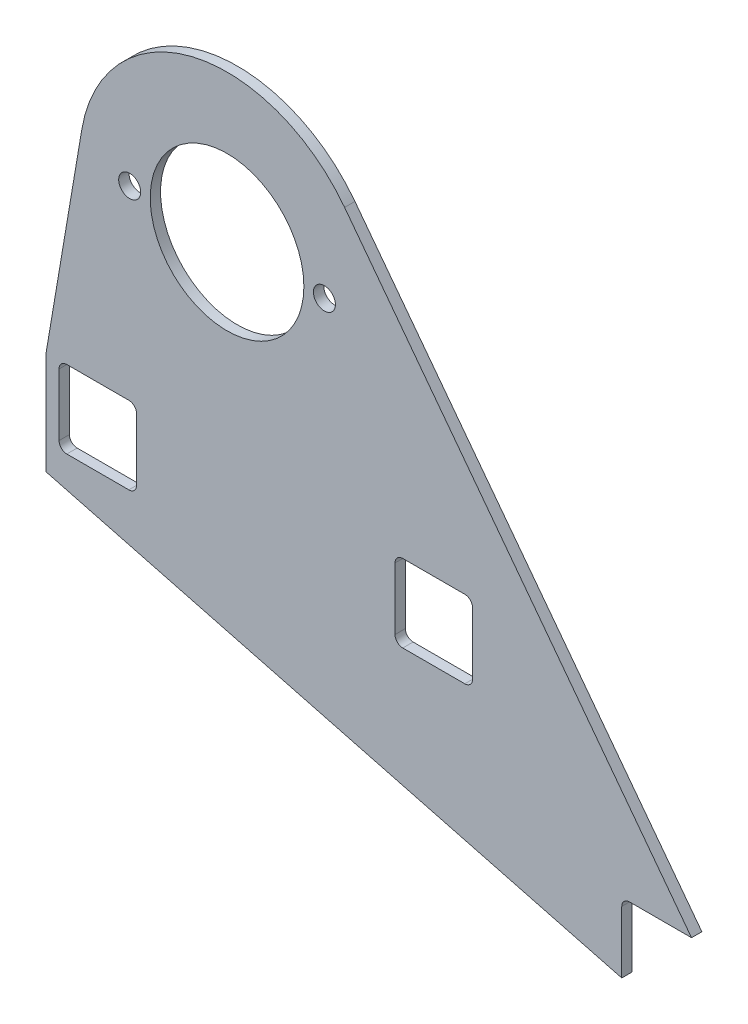
ISO-10303-21;
HEADER;
FILE_DESCRIPTION(('STEP AP214'),'2;1');
FILE_NAME('part.step','',(''),(''),'','','');
FILE_SCHEMA(('AUTOMOTIVE_DESIGN { 1 0 10303 214 1 1 1 1 }'));
ENDSEC;
DATA;
#1=APPLICATION_CONTEXT('core data for automotive mechanical design processes');
#2=APPLICATION_PROTOCOL_DEFINITION('international standard','automotive_design',2000,#1);
#3=PRODUCT_CONTEXT('',#1,'mechanical');
#4=PRODUCT('Part','Part','',(#3));
#5=PRODUCT_RELATED_PRODUCT_CATEGORY('part','',(#4));
#6=PRODUCT_DEFINITION_FORMATION('','',#4);
#7=PRODUCT_DEFINITION_CONTEXT('part definition',#1,'design');
#8=PRODUCT_DEFINITION('design','',#6,#7);
#9=PRODUCT_DEFINITION_SHAPE('','',#8);
#10=(LENGTH_UNIT() NAMED_UNIT(*) SI_UNIT(.MILLI.,.METRE.));
#11=(NAMED_UNIT(*) PLANE_ANGLE_UNIT() SI_UNIT($,.RADIAN.));
#12=(NAMED_UNIT(*) SI_UNIT($,.STERADIAN.) SOLID_ANGLE_UNIT());
#13=UNCERTAINTY_MEASURE_WITH_UNIT(LENGTH_MEASURE(1.E-05),#10,'distance_accuracy_value','');
#14=(GEOMETRIC_REPRESENTATION_CONTEXT(3) GLOBAL_UNCERTAINTY_ASSIGNED_CONTEXT((#13)) GLOBAL_UNIT_ASSIGNED_CONTEXT((#10,
#11,#12)) REPRESENTATION_CONTEXT('',''));
#15=CARTESIAN_POINT('',(0.,0.,0.));
#16=DIRECTION('',(0.,0.,1.));
#17=DIRECTION('',(1.,0.,0.));
#18=AXIS2_PLACEMENT_3D('',#15,#16,#17);
#19=CARTESIAN_POINT('',(-69.9999999999998,-112.,-4.));
#20=DIRECTION('',(-0.2529175302643,-0.96748784120784,0.));
#21=DIRECTION('',(0.96748784120784,-0.2529175302643,0.));
#22=AXIS2_PLACEMENT_3D('',#19,#20,#21);
#23=PLANE('',#22);
#24=DIRECTION('',(0.96748784120784,-0.2529175302643,0.));
#25=VECTOR('',#24,1.);
#26=CARTESIAN_POINT('',(-69.9999999999998,-112.,0.));
#27=LINE('',#26,#25);
#28=CARTESIAN_POINT('',(-69.9999999999998,-112.,0.));
#29=VERTEX_POINT('',#28);
#30=CARTESIAN_POINT('',(152.733197448332,-170.226189319521,0.));
#31=VERTEX_POINT('',#30);
#32=EDGE_CURVE('E331',#29,#31,#27,.T.);
#33=ORIENTED_EDGE('',*,*,#32,.F.);
#34=DIRECTION('',(0.,0.,1.));
#35=VECTOR('',#34,1.);
#36=CARTESIAN_POINT('',(-69.9999999999998,-112.,-4.));
#37=LINE('',#36,#35);
#38=CARTESIAN_POINT('',(-69.9999999999998,-112.,-4.));
#39=VERTEX_POINT('',#38);
#40=EDGE_CURVE('E11',#39,#29,#37,.T.);
#41=ORIENTED_EDGE('',*,*,#40,.F.);
#42=DIRECTION('',(0.96748784120784,-0.2529175302643,0.));
#43=VECTOR('',#42,1.);
#44=CARTESIAN_POINT('',(-69.9999999999998,-112.,-4.));
#45=LINE('',#44,#43);
#46=CARTESIAN_POINT('',(152.733197448332,-170.226189319521,-4.));
#47=VERTEX_POINT('',#46);
#48=EDGE_CURVE('E346',#39,#47,#45,.T.);
#49=ORIENTED_EDGE('',*,*,#48,.T.);
#50=DIRECTION('',(0.,0.,1.));
#51=VECTOR('',#50,1.);
#52=CARTESIAN_POINT('',(152.733197448332,-170.226189319521,-4.));
#53=LINE('',#52,#51);
#54=EDGE_CURVE('E37',#47,#31,#53,.T.);
#55=ORIENTED_EDGE('',*,*,#54,.T.);
#56=EDGE_LOOP('',(#33,#41,#49,#55));
#57=FACE_BOUND('',#56,.T.);
#58=ADVANCED_FACE('F34',(#57),#23,.T.);
#59=CARTESIAN_POINT('',(-69.9999999999998,-72.,-4.));
#60=DIRECTION('',(-1.,0.,0.));
#61=DIRECTION('',(0.,0.,1.));
#62=AXIS2_PLACEMENT_3D('',#59,#60,#61);
#63=PLANE('',#62);
#64=DIRECTION('',(0.,-1.,0.));
#65=VECTOR('',#64,1.);
#66=CARTESIAN_POINT('',(-69.9999999999998,-72.,0.));
#67=LINE('',#66,#65);
#68=CARTESIAN_POINT('',(-69.9999999999998,-72.,0.));
#69=VERTEX_POINT('',#68);
#70=EDGE_CURVE('E350',#69,#29,#67,.T.);
#71=ORIENTED_EDGE('',*,*,#70,.F.);
#72=DIRECTION('',(0.,0.,1.));
#73=VECTOR('',#72,1.);
#74=CARTESIAN_POINT('',(-69.9999999999998,-72.,-4.));
#75=LINE('',#74,#73);
#76=CARTESIAN_POINT('',(-69.9999999999998,-72.,-4.));
#77=VERTEX_POINT('',#76);
#78=EDGE_CURVE('E42',#77,#69,#75,.T.);
#79=ORIENTED_EDGE('',*,*,#78,.F.);
#80=DIRECTION('',(0.,-1.,0.));
#81=VECTOR('',#80,1.);
#82=CARTESIAN_POINT('',(-69.9999999999998,-72.,-4.));
#83=LINE('',#82,#81);
#84=EDGE_CURVE('E368',#77,#39,#83,.T.);
#85=ORIENTED_EDGE('',*,*,#84,.T.);
#86=ORIENTED_EDGE('',*,*,#40,.T.);
#87=EDGE_LOOP('',(#71,#79,#85,#86));
#88=FACE_BOUND('',#87,.T.);
#89=ADVANCED_FACE('F415',(#88),#63,.T.);
#90=CARTESIAN_POINT('',(-69.9999999999998,-72.,-4.));
#91=DIRECTION('',(-0.986021500853317,0.166618125829613,0.));
#92=DIRECTION('',(-0.166618125829613,-0.986021500853317,0.));
#93=AXIS2_PLACEMENT_3D('',#90,#91,#92);
#94=PLANE('',#93);
#95=DIRECTION('',(-0.166618125829613,-0.986021500853317,0.));
#96=VECTOR('',#95,1.);
#97=CARTESIAN_POINT('',(-69.9999999999998,-72.,0.));
#98=LINE('',#97,#96);
#99=CARTESIAN_POINT('',(-56.2278760861603,9.50139862543403,0.));
#100=VERTEX_POINT('',#99);
#101=EDGE_CURVE('E388',#100,#69,#98,.T.);
#102=ORIENTED_EDGE('',*,*,#101,.F.);
#103=DIRECTION('',(0.,0.,1.));
#104=VECTOR('',#103,1.);
#105=CARTESIAN_POINT('',(-56.2278760861603,9.50139862543403,-4.));
#106=LINE('',#105,#104);
#107=CARTESIAN_POINT('',(-56.2278760861603,9.50139862543403,-4.));
#108=VERTEX_POINT('',#107);
#109=EDGE_CURVE('E394',#108,#100,#106,.T.);
#110=ORIENTED_EDGE('',*,*,#109,.F.);
#111=DIRECTION('',(-0.166618125829613,-0.986021500853317,0.));
#112=VECTOR('',#111,1.);
#113=CARTESIAN_POINT('',(-69.9999999999998,-72.,-4.));
#114=LINE('',#113,#112);
#115=EDGE_CURVE('E365',#108,#77,#114,.T.);
#116=ORIENTED_EDGE('',*,*,#115,.T.);
#117=ORIENTED_EDGE('',*,*,#78,.T.);
#118=EDGE_LOOP('',(#102,#110,#116,#117));
#119=FACE_BOUND('',#118,.T.);
#120=ADVANCED_FACE('F435',(#119),#94,.T.);
#121=CARTESIAN_POINT('',(0.,3.88578058618805E-13,-4.));
#122=DIRECTION('',(0.,0.,1.));
#123=DIRECTION('',(1.,0.,0.));
#124=AXIS2_PLACEMENT_3D('',#121,#122,#123);
#125=CYLINDRICAL_SURFACE('',#124,57.0249999999999);
#126=CARTESIAN_POINT('',(0.,3.88578058618805E-13,0.));
#127=DIRECTION('',(0.,0.,1.));
#128=DIRECTION('',(1.,0.,0.));
#129=AXIS2_PLACEMENT_3D('',#126,#127,#128);
#130=CIRCLE('',#129,57.0249999999999);
#131=CARTESIAN_POINT('',(45.4927074926648,34.3840688398982,0.));
#132=VERTEX_POINT('',#131);
#133=EDGE_CURVE('E385',#132,#100,#130,.T.);
#134=ORIENTED_EDGE('',*,*,#133,.F.);
#135=DIRECTION('',(0.,0.,1.));
#136=VECTOR('',#135,1.);
#137=CARTESIAN_POINT('',(45.4927074926648,34.3840688398982,-4.));
#138=LINE('',#137,#136);
#139=CARTESIAN_POINT('',(45.4927074926648,34.3840688398982,-4.));
#140=VERTEX_POINT('',#139);
#141=EDGE_CURVE('E396',#140,#132,#138,.T.);
#142=ORIENTED_EDGE('',*,*,#141,.F.);
#143=CARTESIAN_POINT('',(0.,3.88578058618805E-13,-4.));
#144=DIRECTION('',(0.,0.,1.));
#145=DIRECTION('',(1.,0.,0.));
#146=AXIS2_PLACEMENT_3D('',#143,#144,#145);
#147=CIRCLE('',#146,57.0249999999999);
#148=EDGE_CURVE('E362',#140,#108,#147,.T.);
#149=ORIENTED_EDGE('',*,*,#148,.T.);
#150=ORIENTED_EDGE('',*,*,#109,.T.);
#151=EDGE_LOOP('',(#134,#142,#149,#150));
#152=FACE_BOUND('',#151,.T.);
#153=ADVANCED_FACE('F433',(#152),#125,.T.);
#154=CARTESIAN_POINT('',(179.733197448332,-143.226189319521,-4.));
#155=DIRECTION('',(0.797767777162047,0.602964819638697,0.));
#156=DIRECTION('',(-0.602964819638697,0.797767777162047,0.));
#157=AXIS2_PLACEMENT_3D('',#154,#155,#156);
#158=PLANE('',#157);
#159=DIRECTION('',(-0.602964819638697,0.797767777162047,0.));
#160=VECTOR('',#159,1.);
#161=CARTESIAN_POINT('',(179.733197448332,-143.226189319521,0.));
#162=LINE('',#161,#160);
#163=CARTESIAN_POINT('',(179.733197448332,-143.226189319521,0.));
#164=VERTEX_POINT('',#163);
#165=EDGE_CURVE('E382',#164,#132,#162,.T.);
#166=ORIENTED_EDGE('',*,*,#165,.F.);
#167=DIRECTION('',(0.,0.,1.));
#168=VECTOR('',#167,1.);
#169=CARTESIAN_POINT('',(179.733197448332,-143.226189319521,-4.));
#170=LINE('',#169,#168);
#171=CARTESIAN_POINT('',(179.733197448332,-143.226189319521,-4.));
#172=VERTEX_POINT('',#171);
#173=EDGE_CURVE('E398',#172,#164,#170,.T.);
#174=ORIENTED_EDGE('',*,*,#173,.F.);
#175=DIRECTION('',(-0.602964819638697,0.797767777162047,0.));
#176=VECTOR('',#175,1.);
#177=CARTESIAN_POINT('',(179.733197448332,-143.226189319521,-4.));
#178=LINE('',#177,#176);
#179=EDGE_CURVE('E359',#172,#140,#178,.T.);
#180=ORIENTED_EDGE('',*,*,#179,.T.);
#181=ORIENTED_EDGE('',*,*,#141,.T.);
#182=EDGE_LOOP('',(#166,#174,#180,#181));
#183=FACE_BOUND('',#182,.T.);
#184=ADVANCED_FACE('F429',(#183),#158,.T.);
#185=CARTESIAN_POINT('',(179.733197448332,-143.226189319521,-4.));
#186=DIRECTION('',(0.,-1.,0.));
#187=DIRECTION('',(1.,0.,0.));
#188=AXIS2_PLACEMENT_3D('',#185,#186,#187);
#189=PLANE('',#188);
#190=DIRECTION('',(1.,0.,0.));
#191=VECTOR('',#190,1.);
#192=CARTESIAN_POINT('',(179.733197448332,-143.226189319521,0.));
#193=LINE('',#192,#191);
#194=CARTESIAN_POINT('',(155.733197448332,-143.226189319521,0.));
#195=VERTEX_POINT('',#194);
#196=EDGE_CURVE('E379',#195,#164,#193,.T.);
#197=ORIENTED_EDGE('',*,*,#196,.F.);
#198=DIRECTION('',(0.,0.,1.));
#199=VECTOR('',#198,1.);
#200=CARTESIAN_POINT('',(155.733197448332,-143.226189319521,-4.));
#201=LINE('',#200,#199);
#202=CARTESIAN_POINT('',(155.733197448332,-143.226189319521,-4.));
#203=VERTEX_POINT('',#202);
#204=EDGE_CURVE('E400',#203,#195,#201,.T.);
#205=ORIENTED_EDGE('',*,*,#204,.F.);
#206=DIRECTION('',(1.,0.,0.));
#207=VECTOR('',#206,1.);
#208=CARTESIAN_POINT('',(179.733197448332,-143.226189319521,-4.));
#209=LINE('',#208,#207);
#210=EDGE_CURVE('E356',#203,#172,#209,.T.);
#211=ORIENTED_EDGE('',*,*,#210,.T.);
#212=ORIENTED_EDGE('',*,*,#173,.T.);
#213=EDGE_LOOP('',(#197,#205,#211,#212));
#214=FACE_BOUND('',#213,.T.);
#215=ADVANCED_FACE('F427',(#214),#189,.T.);
#216=CARTESIAN_POINT('',(155.733197448332,-146.226189319521,-4.));
#217=DIRECTION('',(0.,0.,1.));
#218=DIRECTION('',(1.,0.,0.));
#219=AXIS2_PLACEMENT_3D('',#216,#217,#218);
#220=CYLINDRICAL_SURFACE('',#219,2.99999999999999);
#221=CARTESIAN_POINT('',(155.733197448332,-146.226189319521,0.));
#222=DIRECTION('',(0.,0.,-1.));
#223=DIRECTION('',(1.,0.,0.));
#224=AXIS2_PLACEMENT_3D('',#221,#222,#223);
#225=CIRCLE('',#224,2.99999999999999);
#226=CARTESIAN_POINT('',(152.733197448332,-146.226189319521,0.));
#227=VERTEX_POINT('',#226);
#228=EDGE_CURVE('E376',#227,#195,#225,.T.);
#229=ORIENTED_EDGE('',*,*,#228,.F.);
#230=DIRECTION('',(0.,0.,1.));
#231=VECTOR('',#230,1.);
#232=CARTESIAN_POINT('',(152.733197448332,-146.226189319521,-4.));
#233=LINE('',#232,#231);
#234=CARTESIAN_POINT('',(152.733197448332,-146.226189319521,-4.));
#235=VERTEX_POINT('',#234);
#236=EDGE_CURVE('E401',#235,#227,#233,.T.);
#237=ORIENTED_EDGE('',*,*,#236,.F.);
#238=CARTESIAN_POINT('',(155.733197448332,-146.226189319521,-4.));
#239=DIRECTION('',(0.,0.,-1.));
#240=DIRECTION('',(1.,0.,0.));
#241=AXIS2_PLACEMENT_3D('',#238,#239,#240);
#242=CIRCLE('',#241,2.99999999999999);
#243=EDGE_CURVE('E353',#235,#203,#242,.T.);
#244=ORIENTED_EDGE('',*,*,#243,.T.);
#245=ORIENTED_EDGE('',*,*,#204,.T.);
#246=EDGE_LOOP('',(#229,#237,#244,#245));
#247=FACE_BOUND('',#246,.T.);
#248=ADVANCED_FACE('F423',(#247),#220,.F.);
#249=CARTESIAN_POINT('',(152.733197448332,-146.226189319521,-4.));
#250=DIRECTION('',(1.,0.,0.));
#251=DIRECTION('',(0.,0.,-1.));
#252=AXIS2_PLACEMENT_3D('',#249,#250,#251);
#253=PLANE('',#252);
#254=DIRECTION('',(0.,1.,0.));
#255=VECTOR('',#254,1.);
#256=CARTESIAN_POINT('',(152.733197448332,-146.226189319521,0.));
#257=LINE('',#256,#255);
#258=EDGE_CURVE('E373',#31,#227,#257,.T.);
#259=ORIENTED_EDGE('',*,*,#258,.F.);
#260=ORIENTED_EDGE('',*,*,#54,.F.);
#261=DIRECTION('',(0.,1.,0.));
#262=VECTOR('',#261,1.);
#263=CARTESIAN_POINT('',(152.733197448332,-146.226189319521,-4.));
#264=LINE('',#263,#262);
#265=EDGE_CURVE('E349',#47,#235,#264,.T.);
#266=ORIENTED_EDGE('',*,*,#265,.T.);
#267=ORIENTED_EDGE('',*,*,#236,.T.);
#268=EDGE_LOOP('',(#259,#260,#266,#267));
#269=FACE_BOUND('',#268,.T.);
#270=ADVANCED_FACE('F409',(#269),#253,.T.);
#271=CARTESIAN_POINT('',(155.733197448332,-146.226189319521,-4.));
#272=DIRECTION('',(0.,0.,1.));
#273=DIRECTION('',(1.,0.,0.));
#274=AXIS2_PLACEMENT_3D('',#271,#272,#273);
#275=PLANE('',#274);
#276=DIRECTION('',(0.,-1.,0.));
#277=VECTOR('',#276,1.);
#278=CARTESIAN_POINT('',(64.9999999999999,-75.,-4.));
#279=LINE('',#278,#277);
#280=CARTESIAN_POINT('',(64.9999999999999,-75.,-4.));
#281=VERTEX_POINT('',#280);
#282=CARTESIAN_POINT('',(64.9999999999999,-99.,-4.));
#283=VERTEX_POINT('',#282);
#284=EDGE_CURVE('E203',#281,#283,#279,.T.);
#285=ORIENTED_EDGE('',*,*,#284,.T.);
#286=CARTESIAN_POINT('',(68.0000000000001,-99.,-4.));
#287=DIRECTION('',(0.,0.,1.));
#288=DIRECTION('',(1.,0.,0.));
#289=AXIS2_PLACEMENT_3D('',#286,#287,#288);
#290=CIRCLE('',#289,3.);
#291=CARTESIAN_POINT('',(68.0000000000001,-102.,-4.));
#292=VERTEX_POINT('',#291);
#293=EDGE_CURVE('E197',#283,#292,#290,.T.);
#294=ORIENTED_EDGE('',*,*,#293,.T.);
#295=DIRECTION('',(1.,0.,0.));
#296=VECTOR('',#295,1.);
#297=CARTESIAN_POINT('',(68.0000000000001,-102.,-4.));
#298=LINE('',#297,#296);
#299=CARTESIAN_POINT('',(91.9999999999999,-102.,-4.));
#300=VERTEX_POINT('',#299);
#301=EDGE_CURVE('E206',#292,#300,#298,.T.);
#302=ORIENTED_EDGE('',*,*,#301,.T.);
#303=CARTESIAN_POINT('',(91.9999999999999,-99.,-4.));
#304=DIRECTION('',(0.,0.,1.));
#305=DIRECTION('',(1.,0.,0.));
#306=AXIS2_PLACEMENT_3D('',#303,#304,#305);
#307=CIRCLE('',#306,3.);
#308=CARTESIAN_POINT('',(95.,-99.,-4.));
#309=VERTEX_POINT('',#308);
#310=EDGE_CURVE('E50',#300,#309,#307,.T.);
#311=ORIENTED_EDGE('',*,*,#310,.T.);
#312=DIRECTION('',(0.,1.,0.));
#313=VECTOR('',#312,1.);
#314=CARTESIAN_POINT('',(95.,-99.,-4.));
#315=LINE('',#314,#313);
#316=CARTESIAN_POINT('',(95.,-75.,-4.));
#317=VERTEX_POINT('',#316);
#318=EDGE_CURVE('E221',#309,#317,#315,.T.);
#319=ORIENTED_EDGE('',*,*,#318,.T.);
#320=CARTESIAN_POINT('',(91.9999999999999,-75.,-4.));
#321=DIRECTION('',(0.,0.,1.));
#322=DIRECTION('',(1.,0.,0.));
#323=AXIS2_PLACEMENT_3D('',#320,#321,#322);
#324=CIRCLE('',#323,3.);
#325=CARTESIAN_POINT('',(91.9999999999999,-72.,-4.));
#326=VERTEX_POINT('',#325);
#327=EDGE_CURVE('E224',#317,#326,#324,.T.);
#328=ORIENTED_EDGE('',*,*,#327,.T.);
#329=DIRECTION('',(-1.,0.,0.));
#330=VECTOR('',#329,1.);
#331=CARTESIAN_POINT('',(91.9999999999999,-72.,-4.));
#332=LINE('',#331,#330);
#333=CARTESIAN_POINT('',(68.0000000000001,-72.,-4.));
#334=VERTEX_POINT('',#333);
#335=EDGE_CURVE('E227',#326,#334,#332,.T.);
#336=ORIENTED_EDGE('',*,*,#335,.T.);
#337=CARTESIAN_POINT('',(68.0000000000001,-75.,-4.));
#338=DIRECTION('',(0.,0.,1.));
#339=DIRECTION('',(1.,0.,0.));
#340=AXIS2_PLACEMENT_3D('',#337,#338,#339);
#341=CIRCLE('',#340,3.);
#342=EDGE_CURVE('E230',#334,#281,#341,.T.);
#343=ORIENTED_EDGE('',*,*,#342,.T.);
#344=EDGE_LOOP('',(#285,#294,#302,#311,#319,#328,#336,#343));
#345=FACE_BOUND('',#344,.T.);
#346=CARTESIAN_POINT('',(37.6749999999999,0.,-4.));
#347=DIRECTION('',(0.,0.,1.));
#348=DIRECTION('',(1.,0.,0.));
#349=AXIS2_PLACEMENT_3D('',#346,#347,#348);
#350=CIRCLE('',#349,4.25);
#351=CARTESIAN_POINT('',(41.9249999999999,0.,-4.));
#352=VERTEX_POINT('',#351);
#353=EDGE_CURVE('E264',#352,#352,#350,.T.);
#354=ORIENTED_EDGE('',*,*,#353,.T.);
#355=EDGE_LOOP('',(#354));
#356=FACE_BOUND('',#355,.T.);
#357=CARTESIAN_POINT('',(0.,3.88578058618805E-13,-4.));
#358=DIRECTION('',(0.,0.,1.));
#359=DIRECTION('',(1.,0.,0.));
#360=AXIS2_PLACEMENT_3D('',#357,#358,#359);
#361=CIRCLE('',#360,29.732137494637);
#362=CARTESIAN_POINT('',(29.732137494637,3.88578058618805E-13,-4.));
#363=VERTEX_POINT('',#362);
#364=EDGE_CURVE('E270',#363,#363,#361,.T.);
#365=ORIENTED_EDGE('',*,*,#364,.T.);
#366=EDGE_LOOP('',(#365));
#367=FACE_BOUND('',#366,.T.);
#368=CARTESIAN_POINT('',(-37.6749999999999,0.,-4.));
#369=DIRECTION('',(0.,0.,1.));
#370=DIRECTION('',(1.,0.,0.));
#371=AXIS2_PLACEMENT_3D('',#368,#369,#370);
#372=CIRCLE('',#371,4.25);
#373=CARTESIAN_POINT('',(-33.4249999999999,0.,-4.));
#374=VERTEX_POINT('',#373);
#375=EDGE_CURVE('E276',#374,#374,#372,.T.);
#376=ORIENTED_EDGE('',*,*,#375,.T.);
#377=EDGE_LOOP('',(#376));
#378=FACE_BOUND('',#377,.T.);
#379=DIRECTION('',(0.,-1.,0.));
#380=VECTOR('',#379,1.);
#381=CARTESIAN_POINT('',(-64.9999999999999,-75.,-4.));
#382=LINE('',#381,#380);
#383=CARTESIAN_POINT('',(-64.9999999999999,-75.,-4.));
#384=VERTEX_POINT('',#383);
#385=CARTESIAN_POINT('',(-64.9999999999999,-99.,-4.));
#386=VERTEX_POINT('',#385);
#387=EDGE_CURVE('E304',#384,#386,#382,.T.);
#388=ORIENTED_EDGE('',*,*,#387,.T.);
#389=CARTESIAN_POINT('',(-61.9999999999998,-99.,-4.));
#390=DIRECTION('',(0.,0.,1.));
#391=DIRECTION('',(1.,0.,0.));
#392=AXIS2_PLACEMENT_3D('',#389,#390,#391);
#393=CIRCLE('',#392,3.);
#394=CARTESIAN_POINT('',(-61.9999999999998,-102.,-4.));
#395=VERTEX_POINT('',#394);
#396=EDGE_CURVE('E282',#386,#395,#393,.T.);
#397=ORIENTED_EDGE('',*,*,#396,.T.);
#398=DIRECTION('',(1.,0.,0.));
#399=VECTOR('',#398,1.);
#400=CARTESIAN_POINT('',(-61.9999999999998,-102.,-4.));
#401=LINE('',#400,#399);
#402=CARTESIAN_POINT('',(-38.,-102.,-4.));
#403=VERTEX_POINT('',#402);
#404=EDGE_CURVE('E285',#395,#403,#401,.T.);
#405=ORIENTED_EDGE('',*,*,#404,.T.);
#406=CARTESIAN_POINT('',(-37.9999999999998,-99.,-4.));
#407=DIRECTION('',(0.,0.,1.));
#408=DIRECTION('',(1.,0.,0.));
#409=AXIS2_PLACEMENT_3D('',#406,#407,#408);
#410=CIRCLE('',#409,3.);
#411=CARTESIAN_POINT('',(-34.9999999999999,-99.,-4.));
#412=VERTEX_POINT('',#411);
#413=EDGE_CURVE('E289',#403,#412,#410,.T.);
#414=ORIENTED_EDGE('',*,*,#413,.T.);
#415=DIRECTION('',(0.,1.,0.));
#416=VECTOR('',#415,1.);
#417=CARTESIAN_POINT('',(-34.9999999999999,-99.,-4.));
#418=LINE('',#417,#416);
#419=CARTESIAN_POINT('',(-34.9999999999999,-75.,-4.));
#420=VERTEX_POINT('',#419);
#421=EDGE_CURVE('E292',#412,#420,#418,.T.);
#422=ORIENTED_EDGE('',*,*,#421,.T.);
#423=CARTESIAN_POINT('',(-38.,-75.,-4.));
#424=DIRECTION('',(0.,0.,1.));
#425=DIRECTION('',(1.,0.,0.));
#426=AXIS2_PLACEMENT_3D('',#423,#424,#425);
#427=CIRCLE('',#426,3.);
#428=CARTESIAN_POINT('',(-38.,-72.,-4.));
#429=VERTEX_POINT('',#428);
#430=EDGE_CURVE('E295',#420,#429,#427,.T.);
#431=ORIENTED_EDGE('',*,*,#430,.T.);
#432=DIRECTION('',(-1.,0.,0.));
#433=VECTOR('',#432,1.);
#434=CARTESIAN_POINT('',(-38.,-72.,-4.));
#435=LINE('',#434,#433);
#436=CARTESIAN_POINT('',(-61.9999999999998,-72.,-4.));
#437=VERTEX_POINT('',#436);
#438=EDGE_CURVE('E298',#429,#437,#435,.T.);
#439=ORIENTED_EDGE('',*,*,#438,.T.);
#440=CARTESIAN_POINT('',(-61.9999999999998,-75.,-4.));
#441=DIRECTION('',(0.,0.,1.));
#442=DIRECTION('',(1.,0.,0.));
#443=AXIS2_PLACEMENT_3D('',#440,#441,#442);
#444=CIRCLE('',#443,3.);
#445=EDGE_CURVE('E301',#437,#384,#444,.T.);
#446=ORIENTED_EDGE('',*,*,#445,.T.);
#447=EDGE_LOOP('',(#388,#397,#405,#414,#422,#431,#439,#446));
#448=FACE_BOUND('',#447,.T.);
#449=ORIENTED_EDGE('',*,*,#48,.F.);
#450=ORIENTED_EDGE('',*,*,#84,.F.);
#451=ORIENTED_EDGE('',*,*,#115,.F.);
#452=ORIENTED_EDGE('',*,*,#148,.F.);
#453=ORIENTED_EDGE('',*,*,#179,.F.);
#454=ORIENTED_EDGE('',*,*,#210,.F.);
#455=ORIENTED_EDGE('',*,*,#243,.F.);
#456=ORIENTED_EDGE('',*,*,#265,.F.);
#457=EDGE_LOOP('',(#449,#450,#451,#452,#453,#454,#455,#456));
#458=FACE_BOUND('',#457,.T.);
#459=ADVANCED_FACE('F210',(#345,#356,#367,#378,#448,#458),#275,.F.);
#460=CARTESIAN_POINT('',(155.733197448332,-146.226189319521,0.));
#461=DIRECTION('',(0.,0.,1.));
#462=DIRECTION('',(1.,0.,0.));
#463=AXIS2_PLACEMENT_3D('',#460,#461,#462);
#464=PLANE('',#463);
#465=CARTESIAN_POINT('',(68.0000000000001,-99.,0.));
#466=DIRECTION('',(0.,0.,1.));
#467=DIRECTION('',(1.,0.,0.));
#468=AXIS2_PLACEMENT_3D('',#465,#466,#467);
#469=CIRCLE('',#468,3.);
#470=CARTESIAN_POINT('',(64.9999999999999,-99.,0.));
#471=VERTEX_POINT('',#470);
#472=CARTESIAN_POINT('',(68.0000000000001,-102.,0.));
#473=VERTEX_POINT('',#472);
#474=EDGE_CURVE('E58',#471,#473,#469,.T.);
#475=ORIENTED_EDGE('',*,*,#474,.F.);
#476=DIRECTION('',(0.,-1.,0.));
#477=VECTOR('',#476,1.);
#478=CARTESIAN_POINT('',(64.9999999999999,-75.,0.));
#479=LINE('',#478,#477);
#480=CARTESIAN_POINT('',(64.9999999999999,-75.,0.));
#481=VERTEX_POINT('',#480);
#482=EDGE_CURVE('E214',#481,#471,#479,.T.);
#483=ORIENTED_EDGE('',*,*,#482,.F.);
#484=CARTESIAN_POINT('',(68.0000000000001,-75.,0.));
#485=DIRECTION('',(0.,0.,1.));
#486=DIRECTION('',(1.,0.,0.));
#487=AXIS2_PLACEMENT_3D('',#484,#485,#486);
#488=CIRCLE('',#487,3.);
#489=CARTESIAN_POINT('',(68.0000000000001,-72.,0.));
#490=VERTEX_POINT('',#489);
#491=EDGE_CURVE('E217',#490,#481,#488,.T.);
#492=ORIENTED_EDGE('',*,*,#491,.F.);
#493=DIRECTION('',(-1.,0.,0.));
#494=VECTOR('',#493,1.);
#495=CARTESIAN_POINT('',(91.9999999999999,-72.,0.));
#496=LINE('',#495,#494);
#497=CARTESIAN_POINT('',(91.9999999999999,-72.,0.));
#498=VERTEX_POINT('',#497);
#499=EDGE_CURVE('E245',#498,#490,#496,.T.);
#500=ORIENTED_EDGE('',*,*,#499,.F.);
#501=CARTESIAN_POINT('',(91.9999999999999,-75.,0.));
#502=DIRECTION('',(0.,0.,1.));
#503=DIRECTION('',(1.,0.,0.));
#504=AXIS2_PLACEMENT_3D('',#501,#502,#503);
#505=CIRCLE('',#504,3.);
#506=CARTESIAN_POINT('',(95.,-75.,0.));
#507=VERTEX_POINT('',#506);
#508=EDGE_CURVE('E242',#507,#498,#505,.T.);
#509=ORIENTED_EDGE('',*,*,#508,.F.);
#510=DIRECTION('',(0.,1.,0.));
#511=VECTOR('',#510,1.);
#512=CARTESIAN_POINT('',(95.,-99.,0.));
#513=LINE('',#512,#511);
#514=CARTESIAN_POINT('',(95.,-99.,0.));
#515=VERTEX_POINT('',#514);
#516=EDGE_CURVE('E239',#515,#507,#513,.T.);
#517=ORIENTED_EDGE('',*,*,#516,.F.);
#518=CARTESIAN_POINT('',(91.9999999999999,-99.,0.));
#519=DIRECTION('',(0.,0.,1.));
#520=DIRECTION('',(1.,0.,0.));
#521=AXIS2_PLACEMENT_3D('',#518,#519,#520);
#522=CIRCLE('',#521,3.);
#523=CARTESIAN_POINT('',(91.9999999999999,-102.,0.));
#524=VERTEX_POINT('',#523);
#525=EDGE_CURVE('E236',#524,#515,#522,.T.);
#526=ORIENTED_EDGE('',*,*,#525,.F.);
#527=DIRECTION('',(1.,0.,0.));
#528=VECTOR('',#527,1.);
#529=CARTESIAN_POINT('',(68.0000000000001,-102.,0.));
#530=LINE('',#529,#528);
#531=EDGE_CURVE('E234',#473,#524,#530,.T.);
#532=ORIENTED_EDGE('',*,*,#531,.F.);
#533=EDGE_LOOP('',(#475,#483,#492,#500,#509,#517,#526,#532));
#534=FACE_BOUND('',#533,.T.);
#535=CARTESIAN_POINT('',(37.6749999999999,0.,0.));
#536=DIRECTION('',(0.,0.,1.));
#537=DIRECTION('',(1.,0.,0.));
#538=AXIS2_PLACEMENT_3D('',#535,#536,#537);
#539=CIRCLE('',#538,4.25);
#540=CARTESIAN_POINT('',(41.9249999999999,0.,0.));
#541=VERTEX_POINT('',#540);
#542=EDGE_CURVE('E252',#541,#541,#539,.T.);
#543=ORIENTED_EDGE('',*,*,#542,.F.);
#544=EDGE_LOOP('',(#543));
#545=FACE_BOUND('',#544,.T.);
#546=CARTESIAN_POINT('',(0.,3.88578058618805E-13,0.));
#547=DIRECTION('',(0.,0.,1.));
#548=DIRECTION('',(1.,0.,0.));
#549=AXIS2_PLACEMENT_3D('',#546,#547,#548);
#550=CIRCLE('',#549,29.732137494637);
#551=CARTESIAN_POINT('',(29.732137494637,3.88578058618805E-13,0.));
#552=VERTEX_POINT('',#551);
#553=EDGE_CURVE('E267',#552,#552,#550,.T.);
#554=ORIENTED_EDGE('',*,*,#553,.F.);
#555=EDGE_LOOP('',(#554));
#556=FACE_BOUND('',#555,.T.);
#557=CARTESIAN_POINT('',(-37.6749999999999,0.,0.));
#558=DIRECTION('',(0.,0.,1.));
#559=DIRECTION('',(1.,0.,0.));
#560=AXIS2_PLACEMENT_3D('',#557,#558,#559);
#561=CIRCLE('',#560,4.25);
#562=CARTESIAN_POINT('',(-33.4249999999999,0.,0.));
#563=VERTEX_POINT('',#562);
#564=EDGE_CURVE('E273',#563,#563,#561,.T.);
#565=ORIENTED_EDGE('',*,*,#564,.F.);
#566=EDGE_LOOP('',(#565));
#567=FACE_BOUND('',#566,.T.);
#568=CARTESIAN_POINT('',(-61.9999999999998,-99.,0.));
#569=DIRECTION('',(0.,0.,1.));
#570=DIRECTION('',(1.,0.,0.));
#571=AXIS2_PLACEMENT_3D('',#568,#569,#570);
#572=CIRCLE('',#571,3.);
#573=CARTESIAN_POINT('',(-64.9999999999999,-99.,0.));
#574=VERTEX_POINT('',#573);
#575=CARTESIAN_POINT('',(-61.9999999999998,-102.,0.));
#576=VERTEX_POINT('',#575);
#577=EDGE_CURVE('E279',#574,#576,#572,.T.);
#578=ORIENTED_EDGE('',*,*,#577,.F.);
#579=DIRECTION('',(0.,-1.,0.));
#580=VECTOR('',#579,1.);
#581=CARTESIAN_POINT('',(-64.9999999999999,-75.,0.));
#582=LINE('',#581,#580);
#583=CARTESIAN_POINT('',(-64.9999999999999,-75.,0.));
#584=VERTEX_POINT('',#583);
#585=EDGE_CURVE('E286',#584,#574,#582,.T.);
#586=ORIENTED_EDGE('',*,*,#585,.F.);
#587=CARTESIAN_POINT('',(-61.9999999999998,-75.,0.));
#588=DIRECTION('',(0.,0.,1.));
#589=DIRECTION('',(1.,0.,0.));
#590=AXIS2_PLACEMENT_3D('',#587,#588,#589);
#591=CIRCLE('',#590,3.);
#592=CARTESIAN_POINT('',(-61.9999999999998,-72.,0.));
#593=VERTEX_POINT('',#592);
#594=EDGE_CURVE('E324',#593,#584,#591,.T.);
#595=ORIENTED_EDGE('',*,*,#594,.F.);
#596=DIRECTION('',(-1.,0.,0.));
#597=VECTOR('',#596,1.);
#598=CARTESIAN_POINT('',(-38.,-72.,0.));
#599=LINE('',#598,#597);
#600=CARTESIAN_POINT('',(-38.,-72.,0.));
#601=VERTEX_POINT('',#600);
#602=EDGE_CURVE('E321',#601,#593,#599,.T.);
#603=ORIENTED_EDGE('',*,*,#602,.F.);
#604=CARTESIAN_POINT('',(-38.,-75.,0.));
#605=DIRECTION('',(0.,0.,1.));
#606=DIRECTION('',(1.,0.,0.));
#607=AXIS2_PLACEMENT_3D('',#604,#605,#606);
#608=CIRCLE('',#607,3.);
#609=CARTESIAN_POINT('',(-34.9999999999999,-75.,0.));
#610=VERTEX_POINT('',#609);
#611=EDGE_CURVE('E318',#610,#601,#608,.T.);
#612=ORIENTED_EDGE('',*,*,#611,.F.);
#613=DIRECTION('',(0.,1.,0.));
#614=VECTOR('',#613,1.);
#615=CARTESIAN_POINT('',(-34.9999999999999,-99.,0.));
#616=LINE('',#615,#614);
#617=CARTESIAN_POINT('',(-34.9999999999999,-99.,0.));
#618=VERTEX_POINT('',#617);
#619=EDGE_CURVE('E315',#618,#610,#616,.T.);
#620=ORIENTED_EDGE('',*,*,#619,.F.);
#621=CARTESIAN_POINT('',(-37.9999999999998,-99.,0.));
#622=DIRECTION('',(0.,0.,1.));
#623=DIRECTION('',(1.,0.,0.));
#624=AXIS2_PLACEMENT_3D('',#621,#622,#623);
#625=CIRCLE('',#624,3.);
#626=CARTESIAN_POINT('',(-37.9999999999998,-102.,0.));
#627=VERTEX_POINT('',#626);
#628=EDGE_CURVE('E312',#627,#618,#625,.T.);
#629=ORIENTED_EDGE('',*,*,#628,.F.);
#630=DIRECTION('',(1.,0.,0.));
#631=VECTOR('',#630,1.);
#632=CARTESIAN_POINT('',(-61.9999999999998,-102.,0.));
#633=LINE('',#632,#631);
#634=EDGE_CURVE('E309',#576,#627,#633,.T.);
#635=ORIENTED_EDGE('',*,*,#634,.F.);
#636=EDGE_LOOP('',(#578,#586,#595,#603,#612,#620,#629,#635));
#637=FACE_BOUND('',#636,.T.);
#638=ORIENTED_EDGE('',*,*,#32,.T.);
#639=ORIENTED_EDGE('',*,*,#258,.T.);
#640=ORIENTED_EDGE('',*,*,#228,.T.);
#641=ORIENTED_EDGE('',*,*,#196,.T.);
#642=ORIENTED_EDGE('',*,*,#165,.T.);
#643=ORIENTED_EDGE('',*,*,#133,.T.);
#644=ORIENTED_EDGE('',*,*,#101,.T.);
#645=ORIENTED_EDGE('',*,*,#70,.T.);
#646=EDGE_LOOP('',(#638,#639,#640,#641,#642,#643,#644,#645));
#647=FACE_BOUND('',#646,.T.);
#648=ADVANCED_FACE('F411',(#534,#545,#556,#567,#637,#647),#464,.T.);
#649=CARTESIAN_POINT('',(-61.9999999999998,-99.,-4.));
#650=DIRECTION('',(0.,0.,1.));
#651=DIRECTION('',(1.,0.,0.));
#652=AXIS2_PLACEMENT_3D('',#649,#650,#651);
#653=CYLINDRICAL_SURFACE('',#652,3.);
#654=ORIENTED_EDGE('',*,*,#577,.T.);
#655=DIRECTION('',(0.,0.,1.));
#656=VECTOR('',#655,1.);
#657=CARTESIAN_POINT('',(-61.9999999999998,-102.,-4.));
#658=LINE('',#657,#656);
#659=EDGE_CURVE('E307',#395,#576,#658,.T.);
#660=ORIENTED_EDGE('',*,*,#659,.F.);
#661=ORIENTED_EDGE('',*,*,#396,.F.);
#662=DIRECTION('',(0.,0.,1.));
#663=VECTOR('',#662,1.);
#664=CARTESIAN_POINT('',(-64.9999999999999,-99.,-4.));
#665=LINE('',#664,#663);
#666=EDGE_CURVE('E329',#386,#574,#665,.T.);
#667=ORIENTED_EDGE('',*,*,#666,.T.);
#668=EDGE_LOOP('',(#654,#660,#661,#667));
#669=FACE_BOUND('',#668,.T.);
#670=ADVANCED_FACE('F511',(#669),#653,.F.);
#671=CARTESIAN_POINT('',(-64.9999999999999,-75.,-4.));
#672=DIRECTION('',(-1.,0.,0.));
#673=DIRECTION('',(0.,0.,1.));
#674=AXIS2_PLACEMENT_3D('',#671,#672,#673);
#675=PLANE('',#674);
#676=ORIENTED_EDGE('',*,*,#585,.T.);
#677=ORIENTED_EDGE('',*,*,#666,.F.);
#678=ORIENTED_EDGE('',*,*,#387,.F.);
#679=DIRECTION('',(0.,0.,1.));
#680=VECTOR('',#679,1.);
#681=CARTESIAN_POINT('',(-64.9999999999999,-75.,-4.));
#682=LINE('',#681,#680);
#683=EDGE_CURVE('E332',#384,#584,#682,.T.);
#684=ORIENTED_EDGE('',*,*,#683,.T.);
#685=EDGE_LOOP('',(#676,#677,#678,#684));
#686=FACE_BOUND('',#685,.T.);
#687=ADVANCED_FACE('F521',(#686),#675,.F.);
#688=CARTESIAN_POINT('',(-61.9999999999998,-75.,-4.));
#689=DIRECTION('',(0.,0.,1.));
#690=DIRECTION('',(1.,0.,0.));
#691=AXIS2_PLACEMENT_3D('',#688,#689,#690);
#692=CYLINDRICAL_SURFACE('',#691,3.);
#693=ORIENTED_EDGE('',*,*,#594,.T.);
#694=ORIENTED_EDGE('',*,*,#683,.F.);
#695=ORIENTED_EDGE('',*,*,#445,.F.);
#696=DIRECTION('',(0.,0.,1.));
#697=VECTOR('',#696,1.);
#698=CARTESIAN_POINT('',(-61.9999999999998,-72.,-4.));
#699=LINE('',#698,#697);
#700=EDGE_CURVE('E334',#437,#593,#699,.T.);
#701=ORIENTED_EDGE('',*,*,#700,.T.);
#702=EDGE_LOOP('',(#693,#694,#695,#701));
#703=FACE_BOUND('',#702,.T.);
#704=ADVANCED_FACE('F531',(#703),#692,.F.);
#705=CARTESIAN_POINT('',(-38.,-72.,-4.));
#706=DIRECTION('',(0.,1.,0.));
#707=DIRECTION('',(0.,0.,1.));
#708=AXIS2_PLACEMENT_3D('',#705,#706,#707);
#709=PLANE('',#708);
#710=ORIENTED_EDGE('',*,*,#602,.T.);
#711=ORIENTED_EDGE('',*,*,#700,.F.);
#712=ORIENTED_EDGE('',*,*,#438,.F.);
#713=DIRECTION('',(0.,0.,1.));
#714=VECTOR('',#713,1.);
#715=CARTESIAN_POINT('',(-38.,-72.,-4.));
#716=LINE('',#715,#714);
#717=EDGE_CURVE('E336',#429,#601,#716,.T.);
#718=ORIENTED_EDGE('',*,*,#717,.T.);
#719=EDGE_LOOP('',(#710,#711,#712,#718));
#720=FACE_BOUND('',#719,.T.);
#721=ADVANCED_FACE('F541',(#720),#709,.F.);
#722=CARTESIAN_POINT('',(-38.,-75.,-4.));
#723=DIRECTION('',(0.,0.,1.));
#724=DIRECTION('',(1.,0.,0.));
#725=AXIS2_PLACEMENT_3D('',#722,#723,#724);
#726=CYLINDRICAL_SURFACE('',#725,3.);
#727=ORIENTED_EDGE('',*,*,#611,.T.);
#728=ORIENTED_EDGE('',*,*,#717,.F.);
#729=ORIENTED_EDGE('',*,*,#430,.F.);
#730=DIRECTION('',(0.,0.,1.));
#731=VECTOR('',#730,1.);
#732=CARTESIAN_POINT('',(-34.9999999999999,-75.,-4.));
#733=LINE('',#732,#731);
#734=EDGE_CURVE('E338',#420,#610,#733,.T.);
#735=ORIENTED_EDGE('',*,*,#734,.T.);
#736=EDGE_LOOP('',(#727,#728,#729,#735));
#737=FACE_BOUND('',#736,.T.);
#738=ADVANCED_FACE('F551',(#737),#726,.F.);
#739=CARTESIAN_POINT('',(-34.9999999999999,-99.,-4.));
#740=DIRECTION('',(1.,0.,0.));
#741=DIRECTION('',(0.,0.,-1.));
#742=AXIS2_PLACEMENT_3D('',#739,#740,#741);
#743=PLANE('',#742);
#744=ORIENTED_EDGE('',*,*,#619,.T.);
#745=ORIENTED_EDGE('',*,*,#734,.F.);
#746=ORIENTED_EDGE('',*,*,#421,.F.);
#747=DIRECTION('',(0.,0.,1.));
#748=VECTOR('',#747,1.);
#749=CARTESIAN_POINT('',(-34.9999999999999,-99.,-4.));
#750=LINE('',#749,#748);
#751=EDGE_CURVE('E340',#412,#618,#750,.T.);
#752=ORIENTED_EDGE('',*,*,#751,.T.);
#753=EDGE_LOOP('',(#744,#745,#746,#752));
#754=FACE_BOUND('',#753,.T.);
#755=ADVANCED_FACE('F561',(#754),#743,.F.);
#756=CARTESIAN_POINT('',(-37.9999999999998,-99.,-4.));
#757=DIRECTION('',(0.,0.,1.));
#758=DIRECTION('',(1.,0.,0.));
#759=AXIS2_PLACEMENT_3D('',#756,#757,#758);
#760=CYLINDRICAL_SURFACE('',#759,3.);
#761=ORIENTED_EDGE('',*,*,#628,.T.);
#762=ORIENTED_EDGE('',*,*,#751,.F.);
#763=ORIENTED_EDGE('',*,*,#413,.F.);
#764=DIRECTION('',(0.,0.,1.));
#765=VECTOR('',#764,1.);
#766=CARTESIAN_POINT('',(-37.9999999999998,-102.,-4.));
#767=LINE('',#766,#765);
#768=EDGE_CURVE('E342',#403,#627,#767,.T.);
#769=ORIENTED_EDGE('',*,*,#768,.T.);
#770=EDGE_LOOP('',(#761,#762,#763,#769));
#771=FACE_BOUND('',#770,.T.);
#772=ADVANCED_FACE('F571',(#771),#760,.F.);
#773=CARTESIAN_POINT('',(-61.9999999999998,-102.,-4.));
#774=DIRECTION('',(0.,-1.,0.));
#775=DIRECTION('',(0.,0.,-1.));
#776=AXIS2_PLACEMENT_3D('',#773,#774,#775);
#777=PLANE('',#776);
#778=ORIENTED_EDGE('',*,*,#634,.T.);
#779=ORIENTED_EDGE('',*,*,#768,.F.);
#780=ORIENTED_EDGE('',*,*,#404,.F.);
#781=ORIENTED_EDGE('',*,*,#659,.T.);
#782=EDGE_LOOP('',(#778,#779,#780,#781));
#783=FACE_BOUND('',#782,.T.);
#784=ADVANCED_FACE('F581',(#783),#777,.F.);
#785=CARTESIAN_POINT('',(-37.6749999999999,0.,-4.));
#786=DIRECTION('',(0.,0.,1.));
#787=DIRECTION('',(1.,0.,0.));
#788=AXIS2_PLACEMENT_3D('',#785,#786,#787);
#789=CYLINDRICAL_SURFACE('',#788,4.25);
#790=ORIENTED_EDGE('',*,*,#375,.F.);
#791=EDGE_LOOP('',(#790));
#792=FACE_BOUND('',#791,.T.);
#793=ORIENTED_EDGE('',*,*,#564,.T.);
#794=EDGE_LOOP('',(#793));
#795=FACE_BOUND('',#794,.T.);
#796=ADVANCED_FACE('F591',(#792,#795),#789,.F.);
#797=CARTESIAN_POINT('',(0.,3.88578058618805E-13,-4.));
#798=DIRECTION('',(0.,0.,1.));
#799=DIRECTION('',(1.,0.,0.));
#800=AXIS2_PLACEMENT_3D('',#797,#798,#799);
#801=CYLINDRICAL_SURFACE('',#800,29.732137494637);
#802=ORIENTED_EDGE('',*,*,#364,.F.);
#803=EDGE_LOOP('',(#802));
#804=FACE_BOUND('',#803,.T.);
#805=ORIENTED_EDGE('',*,*,#553,.T.);
#806=EDGE_LOOP('',(#805));
#807=FACE_BOUND('',#806,.T.);
#808=ADVANCED_FACE('F601',(#804,#807),#801,.F.);
#809=CARTESIAN_POINT('',(37.6749999999999,0.,-4.));
#810=DIRECTION('',(0.,0.,1.));
#811=DIRECTION('',(1.,0.,0.));
#812=AXIS2_PLACEMENT_3D('',#809,#810,#811);
#813=CYLINDRICAL_SURFACE('',#812,4.25);
#814=ORIENTED_EDGE('',*,*,#353,.F.);
#815=EDGE_LOOP('',(#814));
#816=FACE_BOUND('',#815,.T.);
#817=ORIENTED_EDGE('',*,*,#542,.T.);
#818=EDGE_LOOP('',(#817));
#819=FACE_BOUND('',#818,.T.);
#820=ADVANCED_FACE('F611',(#816,#819),#813,.F.);
#821=CARTESIAN_POINT('',(68.0000000000001,-99.,-4.));
#822=DIRECTION('',(0.,0.,1.));
#823=DIRECTION('',(1.,0.,0.));
#824=AXIS2_PLACEMENT_3D('',#821,#822,#823);
#825=CYLINDRICAL_SURFACE('',#824,3.);
#826=ORIENTED_EDGE('',*,*,#474,.T.);
#827=DIRECTION('',(0.,0.,1.));
#828=VECTOR('',#827,1.);
#829=CARTESIAN_POINT('',(68.0000000000001,-102.,-4.));
#830=LINE('',#829,#828);
#831=EDGE_CURVE('E193',#292,#473,#830,.T.);
#832=ORIENTED_EDGE('',*,*,#831,.F.);
#833=ORIENTED_EDGE('',*,*,#293,.F.);
#834=DIRECTION('',(0.,0.,1.));
#835=VECTOR('',#834,1.);
#836=CARTESIAN_POINT('',(64.9999999999999,-99.,-4.));
#837=LINE('',#836,#835);
#838=EDGE_CURVE('E250',#283,#471,#837,.T.);
#839=ORIENTED_EDGE('',*,*,#838,.T.);
#840=EDGE_LOOP('',(#826,#832,#833,#839));
#841=FACE_BOUND('',#840,.T.);
#842=ADVANCED_FACE('F195',(#841),#825,.F.);
#843=CARTESIAN_POINT('',(64.9999999999999,-75.,-4.));
#844=DIRECTION('',(-1.,0.,0.));
#845=DIRECTION('',(0.,0.,1.));
#846=AXIS2_PLACEMENT_3D('',#843,#844,#845);
#847=PLANE('',#846);
#848=ORIENTED_EDGE('',*,*,#482,.T.);
#849=ORIENTED_EDGE('',*,*,#838,.F.);
#850=ORIENTED_EDGE('',*,*,#284,.F.);
#851=DIRECTION('',(0.,0.,1.));
#852=VECTOR('',#851,1.);
#853=CARTESIAN_POINT('',(64.9999999999999,-75.,-4.));
#854=LINE('',#853,#852);
#855=EDGE_CURVE('E253',#281,#481,#854,.T.);
#856=ORIENTED_EDGE('',*,*,#855,.T.);
#857=EDGE_LOOP('',(#848,#849,#850,#856));
#858=FACE_BOUND('',#857,.T.);
#859=ADVANCED_FACE('F630',(#858),#847,.F.);
#860=CARTESIAN_POINT('',(68.0000000000001,-75.,-4.));
#861=DIRECTION('',(0.,0.,1.));
#862=DIRECTION('',(1.,0.,0.));
#863=AXIS2_PLACEMENT_3D('',#860,#861,#862);
#864=CYLINDRICAL_SURFACE('',#863,3.);
#865=ORIENTED_EDGE('',*,*,#491,.T.);
#866=ORIENTED_EDGE('',*,*,#855,.F.);
#867=ORIENTED_EDGE('',*,*,#342,.F.);
#868=DIRECTION('',(0.,0.,1.));
#869=VECTOR('',#868,1.);
#870=CARTESIAN_POINT('',(68.0000000000001,-72.,-4.));
#871=LINE('',#870,#869);
#872=EDGE_CURVE('E255',#334,#490,#871,.T.);
#873=ORIENTED_EDGE('',*,*,#872,.T.);
#874=EDGE_LOOP('',(#865,#866,#867,#873));
#875=FACE_BOUND('',#874,.T.);
#876=ADVANCED_FACE('F639',(#875),#864,.F.);
#877=CARTESIAN_POINT('',(91.9999999999999,-72.,-4.));
#878=DIRECTION('',(0.,1.,0.));
#879=DIRECTION('',(0.,0.,1.));
#880=AXIS2_PLACEMENT_3D('',#877,#878,#879);
#881=PLANE('',#880);
#882=ORIENTED_EDGE('',*,*,#499,.T.);
#883=ORIENTED_EDGE('',*,*,#872,.F.);
#884=ORIENTED_EDGE('',*,*,#335,.F.);
#885=DIRECTION('',(0.,0.,1.));
#886=VECTOR('',#885,1.);
#887=CARTESIAN_POINT('',(91.9999999999999,-72.,-4.));
#888=LINE('',#887,#886);
#889=EDGE_CURVE('E257',#326,#498,#888,.T.);
#890=ORIENTED_EDGE('',*,*,#889,.T.);
#891=EDGE_LOOP('',(#882,#883,#884,#890));
#892=FACE_BOUND('',#891,.T.);
#893=ADVANCED_FACE('F649',(#892),#881,.F.);
#894=CARTESIAN_POINT('',(91.9999999999999,-75.,-4.));
#895=DIRECTION('',(0.,0.,1.));
#896=DIRECTION('',(1.,0.,0.));
#897=AXIS2_PLACEMENT_3D('',#894,#895,#896);
#898=CYLINDRICAL_SURFACE('',#897,3.);
#899=ORIENTED_EDGE('',*,*,#508,.T.);
#900=ORIENTED_EDGE('',*,*,#889,.F.);
#901=ORIENTED_EDGE('',*,*,#327,.F.);
#902=DIRECTION('',(0.,0.,1.));
#903=VECTOR('',#902,1.);
#904=CARTESIAN_POINT('',(95.,-75.,-4.));
#905=LINE('',#904,#903);
#906=EDGE_CURVE('E259',#317,#507,#905,.T.);
#907=ORIENTED_EDGE('',*,*,#906,.T.);
#908=EDGE_LOOP('',(#899,#900,#901,#907));
#909=FACE_BOUND('',#908,.T.);
#910=ADVANCED_FACE('F659',(#909),#898,.F.);
#911=CARTESIAN_POINT('',(95.,-99.,-4.));
#912=DIRECTION('',(1.,0.,0.));
#913=DIRECTION('',(0.,0.,-1.));
#914=AXIS2_PLACEMENT_3D('',#911,#912,#913);
#915=PLANE('',#914);
#916=ORIENTED_EDGE('',*,*,#516,.T.);
#917=ORIENTED_EDGE('',*,*,#906,.F.);
#918=ORIENTED_EDGE('',*,*,#318,.F.);
#919=DIRECTION('',(0.,0.,1.));
#920=VECTOR('',#919,1.);
#921=CARTESIAN_POINT('',(95.,-99.,-4.));
#922=LINE('',#921,#920);
#923=EDGE_CURVE('E261',#309,#515,#922,.T.);
#924=ORIENTED_EDGE('',*,*,#923,.T.);
#925=EDGE_LOOP('',(#916,#917,#918,#924));
#926=FACE_BOUND('',#925,.T.);
#927=ADVANCED_FACE('F669',(#926),#915,.F.);
#928=CARTESIAN_POINT('',(91.9999999999999,-99.,-4.));
#929=DIRECTION('',(0.,0.,1.));
#930=DIRECTION('',(1.,0.,0.));
#931=AXIS2_PLACEMENT_3D('',#928,#929,#930);
#932=CYLINDRICAL_SURFACE('',#931,3.);
#933=ORIENTED_EDGE('',*,*,#525,.T.);
#934=ORIENTED_EDGE('',*,*,#923,.F.);
#935=ORIENTED_EDGE('',*,*,#310,.F.);
#936=DIRECTION('',(0.,0.,1.));
#937=VECTOR('',#936,1.);
#938=CARTESIAN_POINT('',(91.9999999999999,-102.,-4.));
#939=LINE('',#938,#937);
#940=EDGE_CURVE('E202',#300,#524,#939,.T.);
#941=ORIENTED_EDGE('',*,*,#940,.T.);
#942=EDGE_LOOP('',(#933,#934,#935,#941));
#943=FACE_BOUND('',#942,.T.);
#944=ADVANCED_FACE('F679',(#943),#932,.F.);
#945=CARTESIAN_POINT('',(68.0000000000001,-102.,-4.));
#946=DIRECTION('',(0.,-1.,0.));
#947=DIRECTION('',(0.,0.,-1.));
#948=AXIS2_PLACEMENT_3D('',#945,#946,#947);
#949=PLANE('',#948);
#950=ORIENTED_EDGE('',*,*,#531,.T.);
#951=ORIENTED_EDGE('',*,*,#940,.F.);
#952=ORIENTED_EDGE('',*,*,#301,.F.);
#953=ORIENTED_EDGE('',*,*,#831,.T.);
#954=EDGE_LOOP('',(#950,#951,#952,#953));
#955=FACE_BOUND('',#954,.T.);
#956=ADVANCED_FACE('F207',(#955),#949,.F.);
#957=CLOSED_SHELL('',(#58,#89,#120,#153,#184,#215,#248,#270,#459,#648,#670,#687,#704,#721,#738,
#755,#772,#784,#796,#808,#820,#842,#859,#876,#893,#910,#927,#944,#956));
#958=MANIFOLD_SOLID_BREP('B2',#957);
#959=ADVANCED_BREP_SHAPE_REPRESENTATION('',(#18,#958),#14);
#960=SHAPE_DEFINITION_REPRESENTATION(#9,#959);
ENDSEC;
END-ISO-10303-21;
